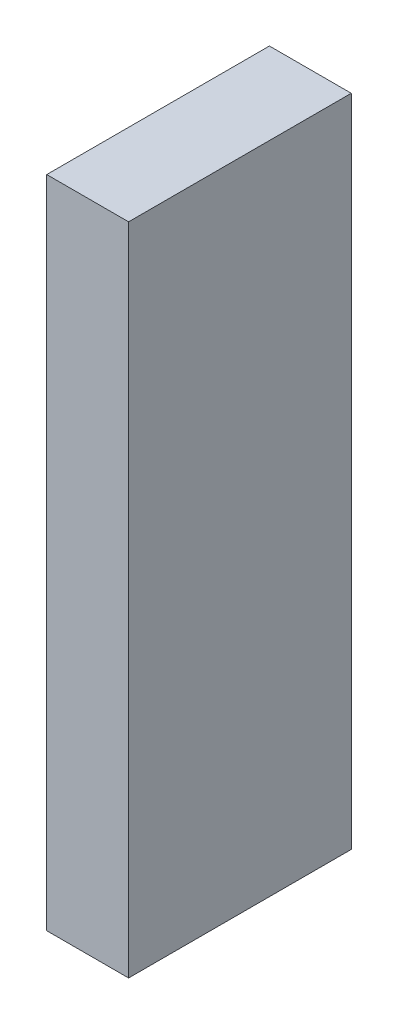
ISO-10303-21;
HEADER;
FILE_DESCRIPTION(('STEP AP214'),'2;1');
FILE_NAME('part.step','',(''),(''),'','','');
FILE_SCHEMA(('AUTOMOTIVE_DESIGN { 1 0 10303 214 1 1 1 1 }'));
ENDSEC;
DATA;
#1=APPLICATION_CONTEXT('core data for automotive mechanical design processes');
#2=APPLICATION_PROTOCOL_DEFINITION('international standard','automotive_design',2000,#1);
#3=PRODUCT_CONTEXT('',#1,'mechanical');
#4=PRODUCT('Part','Part','',(#3));
#5=PRODUCT_RELATED_PRODUCT_CATEGORY('part','',(#4));
#6=PRODUCT_DEFINITION_FORMATION('','',#4);
#7=PRODUCT_DEFINITION_CONTEXT('part definition',#1,'design');
#8=PRODUCT_DEFINITION('design','',#6,#7);
#9=PRODUCT_DEFINITION_SHAPE('','',#8);
#10=(LENGTH_UNIT() NAMED_UNIT(*) SI_UNIT(.MILLI.,.METRE.));
#11=(NAMED_UNIT(*) PLANE_ANGLE_UNIT() SI_UNIT($,.RADIAN.));
#12=(NAMED_UNIT(*) SI_UNIT($,.STERADIAN.) SOLID_ANGLE_UNIT());
#13=UNCERTAINTY_MEASURE_WITH_UNIT(LENGTH_MEASURE(1.E-05),#10,'distance_accuracy_value','');
#14=(GEOMETRIC_REPRESENTATION_CONTEXT(3) GLOBAL_UNCERTAINTY_ASSIGNED_CONTEXT((#13)) GLOBAL_UNIT_ASSIGNED_CONTEXT((#10,
#11,#12)) REPRESENTATION_CONTEXT('',''));
#15=CARTESIAN_POINT('',(0.,0.,0.));
#16=DIRECTION('',(0.,0.,1.));
#17=DIRECTION('',(1.,0.,0.));
#18=AXIS2_PLACEMENT_3D('',#15,#16,#17);
#19=CARTESIAN_POINT('',(3.175,-12.7,-4.318));
#20=DIRECTION('',(0.,0.,1.));
#21=DIRECTION('',(1.,0.,0.));
#22=AXIS2_PLACEMENT_3D('',#19,#20,#21);
#23=PLANE('',#22);
#24=DIRECTION('',(0.,1.,0.));
#25=VECTOR('',#24,1.);
#26=CARTESIAN_POINT('',(0.,-12.7,-4.318));
#27=LINE('',#26,#25);
#28=CARTESIAN_POINT('',(0.,-12.7,-4.318));
#29=VERTEX_POINT('',#28);
#30=CARTESIAN_POINT('',(0.,12.7,-4.318));
#31=VERTEX_POINT('',#30);
#32=EDGE_CURVE('E96',#29,#31,#27,.T.);
#33=ORIENTED_EDGE('',*,*,#32,.T.);
#34=DIRECTION('',(-1.,0.,0.));
#35=VECTOR('',#34,1.);
#36=CARTESIAN_POINT('',(3.175,12.7,-4.318));
#37=LINE('',#36,#35);
#38=CARTESIAN_POINT('',(3.175,12.7,-4.318));
#39=VERTEX_POINT('',#38);
#40=EDGE_CURVE('E11',#39,#31,#37,.T.);
#41=ORIENTED_EDGE('',*,*,#40,.F.);
#42=DIRECTION('',(0.,1.,0.));
#43=VECTOR('',#42,1.);
#44=CARTESIAN_POINT('',(3.175,-12.7,-4.318));
#45=LINE('',#44,#43);
#46=CARTESIAN_POINT('',(3.175,-12.7,-4.318));
#47=VERTEX_POINT('',#46);
#48=EDGE_CURVE('E84',#47,#39,#45,.T.);
#49=ORIENTED_EDGE('',*,*,#48,.F.);
#50=DIRECTION('',(-1.,0.,0.));
#51=VECTOR('',#50,1.);
#52=CARTESIAN_POINT('',(3.175,-12.7,-4.318));
#53=LINE('',#52,#51);
#54=EDGE_CURVE('E92',#47,#29,#53,.T.);
#55=ORIENTED_EDGE('',*,*,#54,.T.);
#56=EDGE_LOOP('',(#33,#41,#49,#55));
#57=FACE_BOUND('',#56,.T.);
#58=ADVANCED_FACE('F33',(#57),#23,.F.);
#59=CARTESIAN_POINT('',(3.175,12.7,4.318));
#60=DIRECTION('',(0.,-1.,0.));
#61=DIRECTION('',(0.,0.,-1.));
#62=AXIS2_PLACEMENT_3D('',#59,#60,#61);
#63=PLANE('',#62);
#64=DIRECTION('',(0.,0.,1.));
#65=VECTOR('',#64,1.);
#66=CARTESIAN_POINT('',(0.,12.7,4.318));
#67=LINE('',#66,#65);
#68=CARTESIAN_POINT('',(0.,12.7,4.318));
#69=VERTEX_POINT('',#68);
#70=EDGE_CURVE('E88',#31,#69,#67,.T.);
#71=ORIENTED_EDGE('',*,*,#70,.T.);
#72=DIRECTION('',(-1.,0.,0.));
#73=VECTOR('',#72,1.);
#74=CARTESIAN_POINT('',(3.175,12.7,4.318));
#75=LINE('',#74,#73);
#76=CARTESIAN_POINT('',(3.175,12.7,4.318));
#77=VERTEX_POINT('',#76);
#78=EDGE_CURVE('E41',#77,#69,#75,.T.);
#79=ORIENTED_EDGE('',*,*,#78,.F.);
#80=DIRECTION('',(0.,0.,1.));
#81=VECTOR('',#80,1.);
#82=CARTESIAN_POINT('',(3.175,12.7,4.318));
#83=LINE('',#82,#81);
#84=EDGE_CURVE('E79',#39,#77,#83,.T.);
#85=ORIENTED_EDGE('',*,*,#84,.F.);
#86=ORIENTED_EDGE('',*,*,#40,.T.);
#87=EDGE_LOOP('',(#71,#79,#85,#86));
#88=FACE_BOUND('',#87,.T.);
#89=ADVANCED_FACE('F87',(#88),#63,.F.);
#90=CARTESIAN_POINT('',(3.175,-12.7,4.318));
#91=DIRECTION('',(0.,0.,-1.));
#92=DIRECTION('',(-1.,0.,0.));
#93=AXIS2_PLACEMENT_3D('',#90,#91,#92);
#94=PLANE('',#93);
#95=DIRECTION('',(0.,-1.,0.));
#96=VECTOR('',#95,1.);
#97=CARTESIAN_POINT('',(0.,-12.7,4.318));
#98=LINE('',#97,#96);
#99=CARTESIAN_POINT('',(0.,-12.7,4.318));
#100=VERTEX_POINT('',#99);
#101=EDGE_CURVE('E66',#69,#100,#98,.T.);
#102=ORIENTED_EDGE('',*,*,#101,.T.);
#103=DIRECTION('',(-1.,0.,0.));
#104=VECTOR('',#103,1.);
#105=CARTESIAN_POINT('',(3.175,-12.7,4.318));
#106=LINE('',#105,#104);
#107=CARTESIAN_POINT('',(3.175,-12.7,4.318));
#108=VERTEX_POINT('',#107);
#109=EDGE_CURVE('E89',#108,#100,#106,.T.);
#110=ORIENTED_EDGE('',*,*,#109,.F.);
#111=DIRECTION('',(0.,-1.,0.));
#112=VECTOR('',#111,1.);
#113=CARTESIAN_POINT('',(3.175,-12.7,4.318));
#114=LINE('',#113,#112);
#115=EDGE_CURVE('E82',#77,#108,#114,.T.);
#116=ORIENTED_EDGE('',*,*,#115,.F.);
#117=ORIENTED_EDGE('',*,*,#78,.T.);
#118=EDGE_LOOP('',(#102,#110,#116,#117));
#119=FACE_BOUND('',#118,.T.);
#120=ADVANCED_FACE('F90',(#119),#94,.F.);
#121=CARTESIAN_POINT('',(3.175,-12.7,4.318));
#122=DIRECTION('',(0.,1.,0.));
#123=DIRECTION('',(0.,0.,1.));
#124=AXIS2_PLACEMENT_3D('',#121,#122,#123);
#125=PLANE('',#124);
#126=DIRECTION('',(0.,0.,-1.));
#127=VECTOR('',#126,1.);
#128=CARTESIAN_POINT('',(0.,-12.7,4.318));
#129=LINE('',#128,#127);
#130=EDGE_CURVE('E72',#100,#29,#129,.T.);
#131=ORIENTED_EDGE('',*,*,#130,.T.);
#132=ORIENTED_EDGE('',*,*,#54,.F.);
#133=DIRECTION('',(0.,0.,-1.));
#134=VECTOR('',#133,1.);
#135=CARTESIAN_POINT('',(3.175,-12.7,4.318));
#136=LINE('',#135,#134);
#137=EDGE_CURVE('E49',#108,#47,#136,.T.);
#138=ORIENTED_EDGE('',*,*,#137,.F.);
#139=ORIENTED_EDGE('',*,*,#109,.T.);
#140=EDGE_LOOP('',(#131,#132,#138,#139));
#141=FACE_BOUND('',#140,.T.);
#142=ADVANCED_FACE('F103',(#141),#125,.F.);
#143=CARTESIAN_POINT('',(3.175,12.7,-4.318));
#144=DIRECTION('',(-1.,0.,0.));
#145=DIRECTION('',(0.,0.,1.));
#146=AXIS2_PLACEMENT_3D('',#143,#144,#145);
#147=PLANE('',#146);
#148=ORIENTED_EDGE('',*,*,#48,.T.);
#149=ORIENTED_EDGE('',*,*,#84,.T.);
#150=ORIENTED_EDGE('',*,*,#115,.T.);
#151=ORIENTED_EDGE('',*,*,#137,.T.);
#152=EDGE_LOOP('',(#148,#149,#150,#151));
#153=FACE_BOUND('',#152,.T.);
#154=ADVANCED_FACE('F80',(#153),#147,.F.);
#155=CARTESIAN_POINT('',(0.,12.7,-4.318));
#156=DIRECTION('',(-1.,0.,0.));
#157=DIRECTION('',(0.,0.,1.));
#158=AXIS2_PLACEMENT_3D('',#155,#156,#157);
#159=PLANE('',#158);
#160=ORIENTED_EDGE('',*,*,#32,.F.);
#161=ORIENTED_EDGE('',*,*,#130,.F.);
#162=ORIENTED_EDGE('',*,*,#101,.F.);
#163=ORIENTED_EDGE('',*,*,#70,.F.);
#164=EDGE_LOOP('',(#160,#161,#162,#163));
#165=FACE_BOUND('',#164,.T.);
#166=ADVANCED_FACE('F106',(#165),#159,.T.);
#167=CLOSED_SHELL('',(#58,#89,#120,#142,#154,#166));
#168=MANIFOLD_SOLID_BREP('B2',#167);
#169=ADVANCED_BREP_SHAPE_REPRESENTATION('',(#18,#168),#14);
#170=SHAPE_DEFINITION_REPRESENTATION(#9,#169);
ENDSEC;
END-ISO-10303-21;
